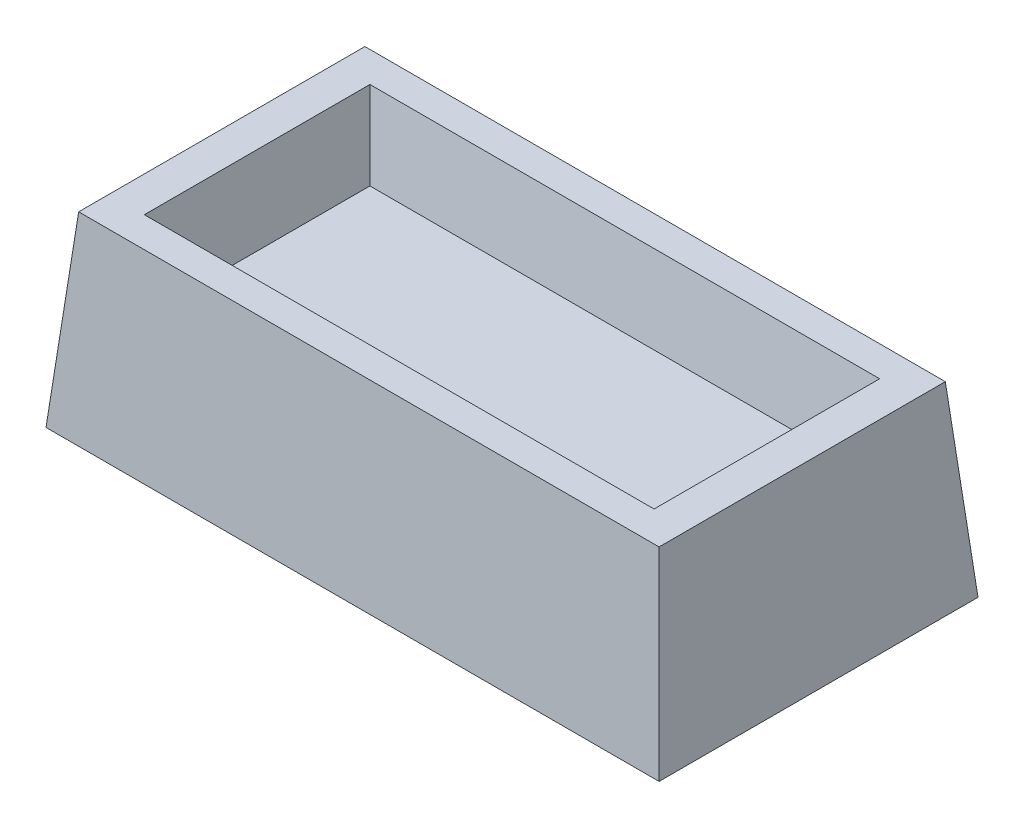
ISO-10303-21;
HEADER;
FILE_DESCRIPTION(('STEP AP214'),'2;1');
FILE_NAME('part.step','',(''),(''),'','','');
FILE_SCHEMA(('AUTOMOTIVE_DESIGN { 1 0 10303 214 1 1 1 1 }'));
ENDSEC;
DATA;
#1=APPLICATION_CONTEXT('core data for automotive mechanical design processes');
#2=APPLICATION_PROTOCOL_DEFINITION('international standard','automotive_design',2000,#1);
#3=PRODUCT_CONTEXT('',#1,'mechanical');
#4=PRODUCT('Part','Part','',(#3));
#5=PRODUCT_RELATED_PRODUCT_CATEGORY('part','',(#4));
#6=PRODUCT_DEFINITION_FORMATION('','',#4);
#7=PRODUCT_DEFINITION_CONTEXT('part definition',#1,'design');
#8=PRODUCT_DEFINITION('design','',#6,#7);
#9=PRODUCT_DEFINITION_SHAPE('','',#8);
#10=(LENGTH_UNIT() NAMED_UNIT(*) SI_UNIT(.MILLI.,.METRE.));
#11=(NAMED_UNIT(*) PLANE_ANGLE_UNIT() SI_UNIT($,.RADIAN.));
#12=(NAMED_UNIT(*) SI_UNIT($,.STERADIAN.) SOLID_ANGLE_UNIT());
#13=UNCERTAINTY_MEASURE_WITH_UNIT(LENGTH_MEASURE(1.E-05),#10,'distance_accuracy_value','');
#14=(GEOMETRIC_REPRESENTATION_CONTEXT(3) GLOBAL_UNCERTAINTY_ASSIGNED_CONTEXT((#13)) GLOBAL_UNIT_ASSIGNED_CONTEXT((#10,
#11,#12)) REPRESENTATION_CONTEXT('',''));
#15=CARTESIAN_POINT('',(0.,0.,0.));
#16=DIRECTION('',(0.,0.,1.));
#17=DIRECTION('',(1.,0.,0.));
#18=AXIS2_PLACEMENT_3D('',#15,#16,#17);
#19=CARTESIAN_POINT('',(0.,0.,0.));
#20=DIRECTION('',(0.,-1.,0.));
#21=DIRECTION('',(0.,0.,-1.));
#22=AXIS2_PLACEMENT_3D('',#19,#20,#21);
#23=PLANE('',#22);
#24=DIRECTION('',(1.,0.,0.));
#25=VECTOR('',#24,1.);
#26=CARTESIAN_POINT('',(-82.0684488740978,0.,42.6888302611235));
#27=LINE('',#26,#25);
#28=CARTESIAN_POINT('',(-82.0684488740978,0.,42.6888302611235));
#29=VERTEX_POINT('',#28);
#30=CARTESIAN_POINT('',(82.0684488740978,0.,42.6888302611235));
#31=VERTEX_POINT('',#30);
#32=EDGE_CURVE('E270',#29,#31,#27,.T.);
#33=ORIENTED_EDGE('',*,*,#32,.F.);
#34=DIRECTION('',(0.,0.,1.));
#35=VECTOR('',#34,1.);
#36=CARTESIAN_POINT('',(-82.0684488740978,0.,-42.6888302611235));
#37=LINE('',#36,#35);
#38=CARTESIAN_POINT('',(-82.0684488740978,0.,-42.6888302611235));
#39=VERTEX_POINT('',#38);
#40=EDGE_CURVE('E306',#39,#29,#37,.T.);
#41=ORIENTED_EDGE('',*,*,#40,.F.);
#42=DIRECTION('',(1.,0.,0.));
#43=VECTOR('',#42,1.);
#44=CARTESIAN_POINT('',(-82.0684488740978,0.,-42.6888302611235));
#45=LINE('',#44,#43);
#46=CARTESIAN_POINT('',(82.0684488740978,0.,-42.6888302611235));
#47=VERTEX_POINT('',#46);
#48=EDGE_CURVE('E302',#39,#47,#45,.T.);
#49=ORIENTED_EDGE('',*,*,#48,.T.);
#50=DIRECTION('',(0.,0.,1.));
#51=VECTOR('',#50,1.);
#52=CARTESIAN_POINT('',(82.0684488740978,0.,-42.6888302611235));
#53=LINE('',#52,#51);
#54=EDGE_CURVE('E298',#47,#31,#53,.T.);
#55=ORIENTED_EDGE('',*,*,#54,.T.);
#56=EDGE_LOOP('',(#33,#41,#49,#55));
#57=FACE_BOUND('',#56,.T.);
#58=DIRECTION('',(0.,0.,-1.));
#59=VECTOR('',#58,1.);
#60=CARTESIAN_POINT('',(-79.0569893614678,0.,0.));
#61=LINE('',#60,#59);
#62=CARTESIAN_POINT('',(-79.0569893614678,0.,-39.6773707484934));
#63=VERTEX_POINT('',#62);
#64=CARTESIAN_POINT('',(-79.0569893614678,0.,39.6773707484934));
#65=VERTEX_POINT('',#64);
#66=EDGE_CURVE('E170',#63,#65,#61,.F.);
#67=ORIENTED_EDGE('',*,*,#66,.T.);
#68=DIRECTION('',(-1.,0.,0.));
#69=VECTOR('',#68,1.);
#70=CARTESIAN_POINT('',(0.,0.,39.6773707484934));
#71=LINE('',#70,#69);
#72=CARTESIAN_POINT('',(79.0569893614678,0.,39.6773707484934));
#73=VERTEX_POINT('',#72);
#74=EDGE_CURVE('E227',#65,#73,#71,.F.);
#75=ORIENTED_EDGE('',*,*,#74,.T.);
#76=DIRECTION('',(0.,0.,1.));
#77=VECTOR('',#76,1.);
#78=CARTESIAN_POINT('',(79.0569893614678,0.,0.));
#79=LINE('',#78,#77);
#80=CARTESIAN_POINT('',(79.0569893614678,0.,-39.6773707484934));
#81=VERTEX_POINT('',#80);
#82=EDGE_CURVE('E177',#81,#73,#79,.T.);
#83=ORIENTED_EDGE('',*,*,#82,.F.);
#84=DIRECTION('',(1.,0.,0.));
#85=VECTOR('',#84,1.);
#86=CARTESIAN_POINT('',(0.,0.,-39.6773707484934));
#87=LINE('',#86,#85);
#88=EDGE_CURVE('E61',#63,#81,#87,.T.);
#89=ORIENTED_EDGE('',*,*,#88,.F.);
#90=EDGE_LOOP('',(#67,#75,#83,#89));
#91=FACE_BOUND('',#90,.T.);
#92=ADVANCED_FACE('F43',(#57,#91),#23,.T.);
#93=CARTESIAN_POINT('',(-82.0684488740978,0.,42.6888302611235));
#94=DIRECTION('',(0.,0.0871557427476582,0.996194698091745));
#95=DIRECTION('',(0.,-0.996194698091746,0.0871557427476582));
#96=AXIS2_PLACEMENT_3D('',#93,#94,#95);
#97=PLANE('',#96);
#98=ORIENTED_EDGE('',*,*,#32,.T.);
#99=DIRECTION('',(-0.0868265938642476,0.992432509138967,-0.0868265938642476));
#100=VECTOR('',#99,1.);
#101=CARTESIAN_POINT('',(80.8310442075565,14.143600058248,41.4514255945822));
#102=LINE('',#101,#100);
#103=CARTESIAN_POINT('',(77.6940156978016,50.,38.3143970848273));
#104=VERTEX_POINT('',#103);
#105=EDGE_CURVE('E11',#104,#31,#102,.F.);
#106=ORIENTED_EDGE('',*,*,#105,.F.);
#107=DIRECTION('',(-1.,0.,0.));
#108=VECTOR('',#107,1.);
#109=CARTESIAN_POINT('',(0.,50.,38.3143970848273));
#110=LINE('',#109,#108);
#111=CARTESIAN_POINT('',(-77.6940156978016,50.,38.3143970848273));
#112=VERTEX_POINT('',#111);
#113=EDGE_CURVE('E308',#112,#104,#110,.F.);
#114=ORIENTED_EDGE('',*,*,#113,.F.);
#115=DIRECTION('',(-0.0868265938642476,-0.992432509138967,0.0868265938642476));
#116=VECTOR('',#115,1.);
#117=CARTESIAN_POINT('',(-82.0684488740978,0.,42.6888302611235));
#118=LINE('',#117,#116);
#119=EDGE_CURVE('E310',#112,#29,#118,.T.);
#120=ORIENTED_EDGE('',*,*,#119,.T.);
#121=EDGE_LOOP('',(#98,#106,#114,#120));
#122=FACE_BOUND('',#121,.T.);
#123=ADVANCED_FACE('F342',(#122),#97,.T.);
#124=CARTESIAN_POINT('',(82.0684488740978,0.,-42.6888302611235));
#125=DIRECTION('',(0.996194698091746,0.0871557427476582,0.));
#126=DIRECTION('',(-0.0871557427476582,0.996194698091746,0.));
#127=AXIS2_PLACEMENT_3D('',#124,#125,#126);
#128=PLANE('',#127);
#129=ORIENTED_EDGE('',*,*,#54,.F.);
#130=DIRECTION('',(0.0868265938642476,-0.992432509138967,-0.0868265938642476));
#131=VECTOR('',#130,1.);
#132=CARTESIAN_POINT('',(80.8310442075565,14.143600058248,-41.4514255945822));
#133=LINE('',#132,#131);
#134=CARTESIAN_POINT('',(77.6940156978016,50.,-38.3143970848273));
#135=VERTEX_POINT('',#134);
#136=EDGE_CURVE('E53',#135,#47,#133,.T.);
#137=ORIENTED_EDGE('',*,*,#136,.F.);
#138=DIRECTION('',(0.,0.,1.));
#139=VECTOR('',#138,1.);
#140=CARTESIAN_POINT('',(77.6940156978016,50.,0.));
#141=LINE('',#140,#139);
#142=EDGE_CURVE('E321',#135,#104,#141,.T.);
#143=ORIENTED_EDGE('',*,*,#142,.T.);
#144=ORIENTED_EDGE('',*,*,#105,.T.);
#145=EDGE_LOOP('',(#129,#137,#143,#144));
#146=FACE_BOUND('',#145,.T.);
#147=ADVANCED_FACE('F45',(#146),#128,.T.);
#148=CARTESIAN_POINT('',(-82.0684488740978,0.,-42.6888302611235));
#149=DIRECTION('',(0.,0.0871557427476582,-0.996194698091745));
#150=DIRECTION('',(0.,0.996194698091746,0.0871557427476582));
#151=AXIS2_PLACEMENT_3D('',#148,#149,#150);
#152=PLANE('',#151);
#153=ORIENTED_EDGE('',*,*,#48,.F.);
#154=DIRECTION('',(0.0868265938642476,0.992432509138967,0.0868265938642476));
#155=VECTOR('',#154,1.);
#156=CARTESIAN_POINT('',(-82.0684488740978,0.,-42.6888302611235));
#157=LINE('',#156,#155);
#158=CARTESIAN_POINT('',(-77.6940156978016,50.,-38.3143970848273));
#159=VERTEX_POINT('',#158);
#160=EDGE_CURVE('E314',#159,#39,#157,.F.);
#161=ORIENTED_EDGE('',*,*,#160,.F.);
#162=DIRECTION('',(1.,0.,0.));
#163=VECTOR('',#162,1.);
#164=CARTESIAN_POINT('',(0.,50.,-38.3143970848273));
#165=LINE('',#164,#163);
#166=EDGE_CURVE('E324',#159,#135,#165,.T.);
#167=ORIENTED_EDGE('',*,*,#166,.T.);
#168=ORIENTED_EDGE('',*,*,#136,.T.);
#169=EDGE_LOOP('',(#153,#161,#167,#168));
#170=FACE_BOUND('',#169,.T.);
#171=ADVANCED_FACE('F346',(#170),#152,.T.);
#172=CARTESIAN_POINT('',(-82.0684488740978,0.,-42.6888302611235));
#173=DIRECTION('',(-0.996194698091746,0.0871557427476582,0.));
#174=DIRECTION('',(-0.0871557427476582,-0.996194698091746,0.));
#175=AXIS2_PLACEMENT_3D('',#172,#173,#174);
#176=PLANE('',#175);
#177=ORIENTED_EDGE('',*,*,#40,.T.);
#178=ORIENTED_EDGE('',*,*,#119,.F.);
#179=DIRECTION('',(0.,0.,-1.));
#180=VECTOR('',#179,1.);
#181=CARTESIAN_POINT('',(-77.6940156978016,50.,0.));
#182=LINE('',#181,#180);
#183=EDGE_CURVE('E47',#159,#112,#182,.F.);
#184=ORIENTED_EDGE('',*,*,#183,.F.);
#185=ORIENTED_EDGE('',*,*,#160,.T.);
#186=EDGE_LOOP('',(#177,#178,#184,#185));
#187=FACE_BOUND('',#186,.T.);
#188=ADVANCED_FACE('F338',(#187),#176,.T.);
#189=CARTESIAN_POINT('',(0.,50.,0.));
#190=DIRECTION('',(0.,-1.,0.));
#191=DIRECTION('',(0.,0.,-1.));
#192=AXIS2_PLACEMENT_3D('',#189,#190,#191);
#193=PLANE('',#192);
#194=DIRECTION('',(-1.,0.,0.));
#195=VECTOR('',#194,1.);
#196=CARTESIAN_POINT('',(-68.2338946785551,50.,-30.1954591393604));
#197=LINE('',#196,#195);
#198=CARTESIAN_POINT('',(68.2338946785551,50.,-30.1954591393604));
#199=VERTEX_POINT('',#198);
#200=CARTESIAN_POINT('',(-68.2338946785551,50.,-30.1954591393604));
#201=VERTEX_POINT('',#200);
#202=EDGE_CURVE('E254',#199,#201,#197,.T.);
#203=ORIENTED_EDGE('',*,*,#202,.F.);
#204=DIRECTION('',(0.,0.,-1.));
#205=VECTOR('',#204,1.);
#206=CARTESIAN_POINT('',(68.2338946785551,50.,-30.1954591393604));
#207=LINE('',#206,#205);
#208=CARTESIAN_POINT('',(68.2338946785551,50.,30.1954591393604));
#209=VERTEX_POINT('',#208);
#210=EDGE_CURVE('E69',#209,#199,#207,.T.);
#211=ORIENTED_EDGE('',*,*,#210,.F.);
#212=DIRECTION('',(1.,0.,0.));
#213=VECTOR('',#212,1.);
#214=CARTESIAN_POINT('',(-68.2338946785551,50.,30.1954591393604));
#215=LINE('',#214,#213);
#216=CARTESIAN_POINT('',(-68.2338946785551,50.,30.1954591393604));
#217=VERTEX_POINT('',#216);
#218=EDGE_CURVE('E262',#217,#209,#215,.T.);
#219=ORIENTED_EDGE('',*,*,#218,.F.);
#220=DIRECTION('',(0.,0.,1.));
#221=VECTOR('',#220,1.);
#222=CARTESIAN_POINT('',(-68.2338946785551,50.,-30.1954591393604));
#223=LINE('',#222,#221);
#224=EDGE_CURVE('E258',#201,#217,#223,.T.);
#225=ORIENTED_EDGE('',*,*,#224,.F.);
#226=EDGE_LOOP('',(#203,#211,#219,#225));
#227=FACE_BOUND('',#226,.T.);
#228=ORIENTED_EDGE('',*,*,#113,.T.);
#229=ORIENTED_EDGE('',*,*,#142,.F.);
#230=ORIENTED_EDGE('',*,*,#166,.F.);
#231=ORIENTED_EDGE('',*,*,#183,.T.);
#232=EDGE_LOOP('',(#228,#229,#230,#231));
#233=FACE_BOUND('',#232,.T.);
#234=ADVANCED_FACE('F333',(#227,#233),#193,.F.);
#235=CARTESIAN_POINT('',(68.2338946785551,50.,-30.1954591393604));
#236=DIRECTION('',(0.984807753012208,-0.17364817766693,0.));
#237=DIRECTION('',(0.17364817766693,0.984807753012208,0.));
#238=AXIS2_PLACEMENT_3D('',#235,#236,#237);
#239=PLANE('',#238);
#240=ORIENTED_EDGE('',*,*,#210,.T.);
#241=DIRECTION('',(0.171087869746036,0.970287525247814,-0.171087869746036));
#242=VECTOR('',#241,1.);
#243=CARTESIAN_POINT('',(68.2338946785551,50.,-30.1954591393604));
#244=LINE('',#243,#242);
#245=CARTESIAN_POINT('',(64.7073550643858,30.,-26.6689195251911));
#246=VERTEX_POINT('',#245);
#247=EDGE_CURVE('E272',#246,#199,#244,.T.);
#248=ORIENTED_EDGE('',*,*,#247,.F.);
#249=DIRECTION('',(0.,0.,-1.));
#250=VECTOR('',#249,1.);
#251=CARTESIAN_POINT('',(64.7073550643858,30.,0.));
#252=LINE('',#251,#250);
#253=CARTESIAN_POINT('',(64.7073550643858,30.,26.6689195251911));
#254=VERTEX_POINT('',#253);
#255=EDGE_CURVE('E266',#254,#246,#252,.T.);
#256=ORIENTED_EDGE('',*,*,#255,.F.);
#257=DIRECTION('',(0.171087869746036,0.970287525247814,0.171087869746036));
#258=VECTOR('',#257,1.);
#259=CARTESIAN_POINT('',(64.2393379409059,27.3457429963387,26.2009024017112));
#260=LINE('',#259,#258);
#261=EDGE_CURVE('E267',#254,#209,#260,.T.);
#262=ORIENTED_EDGE('',*,*,#261,.T.);
#263=EDGE_LOOP('',(#240,#248,#256,#262));
#264=FACE_BOUND('',#263,.T.);
#265=ADVANCED_FACE('F395',(#264),#239,.F.);
#266=CARTESIAN_POINT('',(-68.2338946785551,50.,30.1954591393604));
#267=DIRECTION('',(0.,-0.17364817766693,0.984807753012208));
#268=DIRECTION('',(0.,-0.984807753012208,-0.17364817766693));
#269=AXIS2_PLACEMENT_3D('',#266,#267,#268);
#270=PLANE('',#269);
#271=ORIENTED_EDGE('',*,*,#218,.T.);
#272=ORIENTED_EDGE('',*,*,#261,.F.);
#273=DIRECTION('',(1.,0.,0.));
#274=VECTOR('',#273,1.);
#275=CARTESIAN_POINT('',(0.,30.,26.6689195251911));
#276=LINE('',#275,#274);
#277=CARTESIAN_POINT('',(-64.7073550643858,30.,26.6689195251911));
#278=VERTEX_POINT('',#277);
#279=EDGE_CURVE('E276',#278,#254,#276,.T.);
#280=ORIENTED_EDGE('',*,*,#279,.F.);
#281=DIRECTION('',(-0.171087869746036,0.970287525247814,0.171087869746036));
#282=VECTOR('',#281,1.);
#283=CARTESIAN_POINT('',(-66.4661885360321,39.9748402914833,28.4277529968375));
#284=LINE('',#283,#282);
#285=EDGE_CURVE('E271',#278,#217,#284,.T.);
#286=ORIENTED_EDGE('',*,*,#285,.T.);
#287=EDGE_LOOP('',(#271,#272,#280,#286));
#288=FACE_BOUND('',#287,.T.);
#289=ADVANCED_FACE('F398',(#288),#270,.F.);
#290=CARTESIAN_POINT('',(-68.2338946785551,50.,-30.1954591393604));
#291=DIRECTION('',(-0.984807753012208,-0.17364817766693,0.));
#292=DIRECTION('',(0.17364817766693,-0.984807753012208,0.));
#293=AXIS2_PLACEMENT_3D('',#290,#291,#292);
#294=PLANE('',#293);
#295=ORIENTED_EDGE('',*,*,#224,.T.);
#296=ORIENTED_EDGE('',*,*,#285,.F.);
#297=DIRECTION('',(0.,0.,1.));
#298=VECTOR('',#297,1.);
#299=CARTESIAN_POINT('',(-64.7073550643858,30.,0.));
#300=LINE('',#299,#298);
#301=CARTESIAN_POINT('',(-64.7073550643858,30.,-26.6689195251911));
#302=VERTEX_POINT('',#301);
#303=EDGE_CURVE('E288',#302,#278,#300,.T.);
#304=ORIENTED_EDGE('',*,*,#303,.F.);
#305=DIRECTION('',(-0.171087869746036,0.970287525247814,-0.171087869746036));
#306=VECTOR('',#305,1.);
#307=CARTESIAN_POINT('',(-68.2338946785551,50.,-30.1954591393604));
#308=LINE('',#307,#306);
#309=EDGE_CURVE('E275',#302,#201,#308,.T.);
#310=ORIENTED_EDGE('',*,*,#309,.T.);
#311=EDGE_LOOP('',(#295,#296,#304,#310));
#312=FACE_BOUND('',#311,.T.);
#313=ADVANCED_FACE('F401',(#312),#294,.F.);
#314=CARTESIAN_POINT('',(-68.2338946785551,50.,-30.1954591393604));
#315=DIRECTION('',(0.,-0.17364817766693,-0.984807753012208));
#316=DIRECTION('',(0.,0.984807753012208,-0.17364817766693));
#317=AXIS2_PLACEMENT_3D('',#314,#315,#316);
#318=PLANE('',#317);
#319=ORIENTED_EDGE('',*,*,#202,.T.);
#320=ORIENTED_EDGE('',*,*,#309,.F.);
#321=DIRECTION('',(-1.,0.,0.));
#322=VECTOR('',#321,1.);
#323=CARTESIAN_POINT('',(0.,30.,-26.6689195251911));
#324=LINE('',#323,#322);
#325=EDGE_CURVE('E284',#246,#302,#324,.T.);
#326=ORIENTED_EDGE('',*,*,#325,.F.);
#327=ORIENTED_EDGE('',*,*,#247,.T.);
#328=EDGE_LOOP('',(#319,#320,#326,#327));
#329=FACE_BOUND('',#328,.T.);
#330=ADVANCED_FACE('F393',(#329),#318,.F.);
#331=CARTESIAN_POINT('',(0.,30.,0.));
#332=DIRECTION('',(0.,1.,0.));
#333=DIRECTION('',(0.,0.,1.));
#334=AXIS2_PLACEMENT_3D('',#331,#332,#333);
#335=PLANE('',#334);
#336=ORIENTED_EDGE('',*,*,#255,.T.);
#337=ORIENTED_EDGE('',*,*,#325,.T.);
#338=ORIENTED_EDGE('',*,*,#303,.T.);
#339=ORIENTED_EDGE('',*,*,#279,.T.);
#340=EDGE_LOOP('',(#336,#337,#338,#339));
#341=FACE_BOUND('',#340,.T.);
#342=ADVANCED_FACE('F390',(#341),#335,.T.);
#343=CARTESIAN_POINT('',(-82.0684488740978,-0.261467228242975,39.7002461668482));
#344=DIRECTION('',(0.,0.0871557427476582,0.996194698091745));
#345=DIRECTION('',(0.,-0.996194698091746,0.0871557427476582));
#346=AXIS2_PLACEMENT_3D('',#343,#344,#345);
#347=PLANE('',#346);
#348=ORIENTED_EDGE('',*,*,#74,.F.);
#349=DIRECTION('',(-0.0868265938642476,-0.992432509138967,0.0868265938642476));
#350=VECTOR('',#349,1.);
#351=CARTESIAN_POINT('',(-79.1023952891434,-0.518992128187875,39.7227766761691));
#352=LINE('',#351,#350);
#353=CARTESIAN_POINT('',(-74.9450221757493,47.,35.565403562775));
#354=VERTEX_POINT('',#353);
#355=EDGE_CURVE('E164',#354,#65,#352,.T.);
#356=ORIENTED_EDGE('',*,*,#355,.F.);
#357=DIRECTION('',(-1.,0.,0.));
#358=VECTOR('',#357,1.);
#359=CARTESIAN_POINT('',(0.,47.,35.565403562775));
#360=LINE('',#359,#358);
#361=CARTESIAN_POINT('',(74.9450221757493,47.,35.565403562775));
#362=VERTEX_POINT('',#361);
#363=EDGE_CURVE('E158',#354,#362,#360,.F.);
#364=ORIENTED_EDGE('',*,*,#363,.T.);
#365=DIRECTION('',(-0.0868265938642476,0.992432509138967,-0.0868265938642476));
#366=VECTOR('',#365,1.);
#367=CARTESIAN_POINT('',(77.8649906226021,13.6246079300601,38.4853720096278));
#368=LINE('',#367,#366);
#369=EDGE_CURVE('E162',#362,#73,#368,.F.);
#370=ORIENTED_EDGE('',*,*,#369,.T.);
#371=EDGE_LOOP('',(#348,#356,#364,#370));
#372=FACE_BOUND('',#371,.T.);
#373=ADVANCED_FACE('F161',(#372),#347,.F.);
#374=CARTESIAN_POINT('',(79.0798647798226,-0.261467228242975,-42.6888302611235));
#375=DIRECTION('',(0.996194698091746,0.0871557427476582,0.));
#376=DIRECTION('',(-0.0871557427476582,0.996194698091746,0.));
#377=AXIS2_PLACEMENT_3D('',#374,#375,#376);
#378=PLANE('',#377);
#379=ORIENTED_EDGE('',*,*,#82,.T.);
#380=ORIENTED_EDGE('',*,*,#369,.F.);
#381=DIRECTION('',(0.,0.,1.));
#382=VECTOR('',#381,1.);
#383=CARTESIAN_POINT('',(74.9450221757493,47.,0.));
#384=LINE('',#383,#382);
#385=CARTESIAN_POINT('',(74.9450221757493,47.,-35.565403562775));
#386=VERTEX_POINT('',#385);
#387=EDGE_CURVE('E169',#386,#362,#384,.T.);
#388=ORIENTED_EDGE('',*,*,#387,.F.);
#389=DIRECTION('',(0.0868265938642476,-0.992432509138967,-0.0868265938642476));
#390=VECTOR('',#389,1.);
#391=CARTESIAN_POINT('',(77.8649906226021,13.6246079300601,-38.4853720096278));
#392=LINE('',#391,#390);
#393=EDGE_CURVE('E180',#386,#81,#392,.T.);
#394=ORIENTED_EDGE('',*,*,#393,.T.);
#395=EDGE_LOOP('',(#379,#380,#388,#394));
#396=FACE_BOUND('',#395,.T.);
#397=ADVANCED_FACE('F174',(#396),#378,.F.);
#398=CARTESIAN_POINT('',(-82.0684488740978,-0.261467228242975,-39.7002461668482));
#399=DIRECTION('',(0.,0.0871557427476582,-0.996194698091745));
#400=DIRECTION('',(0.,0.996194698091746,0.0871557427476582));
#401=AXIS2_PLACEMENT_3D('',#398,#399,#400);
#402=PLANE('',#401);
#403=ORIENTED_EDGE('',*,*,#88,.T.);
#404=ORIENTED_EDGE('',*,*,#393,.F.);
#405=DIRECTION('',(1.,0.,0.));
#406=VECTOR('',#405,1.);
#407=CARTESIAN_POINT('',(0.,47.,-35.565403562775));
#408=LINE('',#407,#406);
#409=CARTESIAN_POINT('',(-74.9450221757493,47.,-35.565403562775));
#410=VERTEX_POINT('',#409);
#411=EDGE_CURVE('E184',#410,#386,#408,.T.);
#412=ORIENTED_EDGE('',*,*,#411,.F.);
#413=DIRECTION('',(0.0868265938642476,0.992432509138967,0.0868265938642476));
#414=VECTOR('',#413,1.);
#415=CARTESIAN_POINT('',(-79.1023952891434,-0.518992128187875,-39.7227766761691));
#416=LINE('',#415,#414);
#417=EDGE_CURVE('E193',#410,#63,#416,.F.);
#418=ORIENTED_EDGE('',*,*,#417,.T.);
#419=EDGE_LOOP('',(#403,#404,#412,#418));
#420=FACE_BOUND('',#419,.T.);
#421=ADVANCED_FACE('F356',(#420),#402,.F.);
#422=CARTESIAN_POINT('',(-79.0798647798226,-0.261467228242975,-42.6888302611235));
#423=DIRECTION('',(-0.996194698091746,0.0871557427476582,0.));
#424=DIRECTION('',(-0.0871557427476582,-0.996194698091746,0.));
#425=AXIS2_PLACEMENT_3D('',#422,#423,#424);
#426=PLANE('',#425);
#427=ORIENTED_EDGE('',*,*,#66,.F.);
#428=ORIENTED_EDGE('',*,*,#417,.F.);
#429=DIRECTION('',(0.,0.,-1.));
#430=VECTOR('',#429,1.);
#431=CARTESIAN_POINT('',(-74.9450221757493,47.,0.));
#432=LINE('',#431,#430);
#433=EDGE_CURVE('E188',#410,#354,#432,.F.);
#434=ORIENTED_EDGE('',*,*,#433,.T.);
#435=ORIENTED_EDGE('',*,*,#355,.T.);
#436=EDGE_LOOP('',(#427,#428,#434,#435));
#437=FACE_BOUND('',#436,.T.);
#438=ADVANCED_FACE('F353',(#437),#426,.F.);
#439=CARTESIAN_POINT('',(0.,47.,0.));
#440=DIRECTION('',(0.,-1.,0.));
#441=DIRECTION('',(0.,0.,-1.));
#442=AXIS2_PLACEMENT_3D('',#439,#440,#441);
#443=PLANE('',#442);
#444=DIRECTION('',(-1.,0.,0.));
#445=VECTOR('',#444,1.);
#446=CARTESIAN_POINT('',(-68.2338946785551,47.,-32.7127580328922));
#447=LINE('',#446,#445);
#448=CARTESIAN_POINT('',(70.7511935720869,47.,-32.7127580328922));
#449=VERTEX_POINT('',#448);
#450=CARTESIAN_POINT('',(-70.7511935720869,47.,-32.7127580328922));
#451=VERTEX_POINT('',#450);
#452=EDGE_CURVE('E198',#449,#451,#447,.T.);
#453=ORIENTED_EDGE('',*,*,#452,.T.);
#454=DIRECTION('',(0.,0.,1.));
#455=VECTOR('',#454,1.);
#456=CARTESIAN_POINT('',(-70.7511935720869,47.,-30.1954591393604));
#457=LINE('',#456,#455);
#458=CARTESIAN_POINT('',(-70.7511935720869,47.,32.7127580328922));
#459=VERTEX_POINT('',#458);
#460=EDGE_CURVE('E202',#451,#459,#457,.T.);
#461=ORIENTED_EDGE('',*,*,#460,.T.);
#462=DIRECTION('',(1.,0.,0.));
#463=VECTOR('',#462,1.);
#464=CARTESIAN_POINT('',(-68.2338946785551,47.,32.7127580328922));
#465=LINE('',#464,#463);
#466=CARTESIAN_POINT('',(70.7511935720869,47.,32.7127580328922));
#467=VERTEX_POINT('',#466);
#468=EDGE_CURVE('E206',#459,#467,#465,.T.);
#469=ORIENTED_EDGE('',*,*,#468,.T.);
#470=DIRECTION('',(0.,0.,-1.));
#471=VECTOR('',#470,1.);
#472=CARTESIAN_POINT('',(70.7511935720869,47.,-30.1954591393604));
#473=LINE('',#472,#471);
#474=EDGE_CURVE('E203',#467,#449,#473,.T.);
#475=ORIENTED_EDGE('',*,*,#474,.T.);
#476=EDGE_LOOP('',(#453,#461,#469,#475));
#477=FACE_BOUND('',#476,.T.);
#478=ORIENTED_EDGE('',*,*,#363,.F.);
#479=ORIENTED_EDGE('',*,*,#433,.F.);
#480=ORIENTED_EDGE('',*,*,#411,.T.);
#481=ORIENTED_EDGE('',*,*,#387,.T.);
#482=EDGE_LOOP('',(#478,#479,#480,#481));
#483=FACE_BOUND('',#482,.T.);
#484=ADVANCED_FACE('F182',(#477,#483),#443,.T.);
#485=CARTESIAN_POINT('',(71.1883179375917,49.4790554669992,-30.1954591393604));
#486=DIRECTION('',(0.984807753012208,-0.17364817766693,0.));
#487=DIRECTION('',(0.17364817766693,0.984807753012208,0.));
#488=AXIS2_PLACEMENT_3D('',#485,#486,#487);
#489=PLANE('',#488);
#490=ORIENTED_EDGE('',*,*,#474,.F.);
#491=DIRECTION('',(0.171087869746036,0.970287525247814,0.171087869746036));
#492=VECTOR('',#491,1.);
#493=CARTESIAN_POINT('',(67.1072821019015,26.334351126841,29.0688465627068));
#494=LINE('',#493,#492);
#495=CARTESIAN_POINT('',(67.2246539579176,27.,29.1862184187229));
#496=VERTEX_POINT('',#495);
#497=EDGE_CURVE('E224',#496,#467,#494,.T.);
#498=ORIENTED_EDGE('',*,*,#497,.F.);
#499=DIRECTION('',(0.,0.,-1.));
#500=VECTOR('',#499,1.);
#501=CARTESIAN_POINT('',(67.2246539579176,27.,0.));
#502=LINE('',#501,#500);
#503=CARTESIAN_POINT('',(67.2246539579176,27.,-29.1862184187229));
#504=VERTEX_POINT('',#503);
#505=EDGE_CURVE('E210',#496,#504,#502,.T.);
#506=ORIENTED_EDGE('',*,*,#505,.T.);
#507=DIRECTION('',(0.171087869746036,0.970287525247814,-0.171087869746036));
#508=VECTOR('',#507,1.);
#509=CARTESIAN_POINT('',(71.1018388395507,48.9886081305024,-33.063403300356));
#510=LINE('',#509,#508);
#511=EDGE_CURVE('E214',#504,#449,#510,.T.);
#512=ORIENTED_EDGE('',*,*,#511,.T.);
#513=EDGE_LOOP('',(#490,#498,#506,#512));
#514=FACE_BOUND('',#513,.T.);
#515=ADVANCED_FACE('F369',(#514),#489,.T.);
#516=CARTESIAN_POINT('',(-68.2338946785551,49.4790554669992,33.149882398397));
#517=DIRECTION('',(0.,-0.17364817766693,0.984807753012208));
#518=DIRECTION('',(0.,-0.984807753012208,-0.17364817766693));
#519=AXIS2_PLACEMENT_3D('',#516,#517,#518);
#520=PLANE('',#519);
#521=ORIENTED_EDGE('',*,*,#468,.F.);
#522=DIRECTION('',(-0.171087869746036,0.970287525247814,0.171087869746036));
#523=VECTOR('',#522,1.);
#524=CARTESIAN_POINT('',(-69.3341326970278,38.9634484219856,31.2956971578331));
#525=LINE('',#524,#523);
#526=CARTESIAN_POINT('',(-67.2246539579176,27.,29.1862184187229));
#527=VERTEX_POINT('',#526);
#528=EDGE_CURVE('E228',#527,#459,#525,.T.);
#529=ORIENTED_EDGE('',*,*,#528,.F.);
#530=DIRECTION('',(1.,0.,0.));
#531=VECTOR('',#530,1.);
#532=CARTESIAN_POINT('',(0.,27.,29.1862184187229));
#533=LINE('',#532,#531);
#534=EDGE_CURVE('E219',#527,#496,#533,.T.);
#535=ORIENTED_EDGE('',*,*,#534,.T.);
#536=ORIENTED_EDGE('',*,*,#497,.T.);
#537=EDGE_LOOP('',(#521,#529,#535,#536));
#538=FACE_BOUND('',#537,.T.);
#539=ADVANCED_FACE('F373',(#538),#520,.T.);
#540=CARTESIAN_POINT('',(-71.1883179375917,49.4790554669992,-30.1954591393604));
#541=DIRECTION('',(-0.984807753012208,-0.17364817766693,0.));
#542=DIRECTION('',(0.17364817766693,-0.984807753012208,0.));
#543=AXIS2_PLACEMENT_3D('',#540,#541,#542);
#544=PLANE('',#543);
#545=ORIENTED_EDGE('',*,*,#460,.F.);
#546=DIRECTION('',(-0.171087869746036,0.970287525247814,-0.171087869746036));
#547=VECTOR('',#546,1.);
#548=CARTESIAN_POINT('',(-71.1018388395507,48.9886081305024,-33.063403300356));
#549=LINE('',#548,#547);
#550=CARTESIAN_POINT('',(-67.2246539579176,27.,-29.1862184187229));
#551=VERTEX_POINT('',#550);
#552=EDGE_CURVE('E218',#551,#451,#549,.T.);
#553=ORIENTED_EDGE('',*,*,#552,.F.);
#554=DIRECTION('',(0.,0.,1.));
#555=VECTOR('',#554,1.);
#556=CARTESIAN_POINT('',(-67.2246539579176,27.,0.));
#557=LINE('',#556,#555);
#558=EDGE_CURVE('E232',#551,#527,#557,.T.);
#559=ORIENTED_EDGE('',*,*,#558,.T.);
#560=ORIENTED_EDGE('',*,*,#528,.T.);
#561=EDGE_LOOP('',(#545,#553,#559,#560));
#562=FACE_BOUND('',#561,.T.);
#563=ADVANCED_FACE('F377',(#562),#544,.T.);
#564=CARTESIAN_POINT('',(-68.2338946785551,49.4790554669992,-33.149882398397));
#565=DIRECTION('',(0.,-0.17364817766693,-0.984807753012208));
#566=DIRECTION('',(0.,0.984807753012208,-0.17364817766693));
#567=AXIS2_PLACEMENT_3D('',#564,#565,#566);
#568=PLANE('',#567);
#569=ORIENTED_EDGE('',*,*,#452,.F.);
#570=ORIENTED_EDGE('',*,*,#511,.F.);
#571=DIRECTION('',(-1.,0.,0.));
#572=VECTOR('',#571,1.);
#573=CARTESIAN_POINT('',(0.,27.,-29.1862184187229));
#574=LINE('',#573,#572);
#575=EDGE_CURVE('E223',#504,#551,#574,.T.);
#576=ORIENTED_EDGE('',*,*,#575,.T.);
#577=ORIENTED_EDGE('',*,*,#552,.T.);
#578=EDGE_LOOP('',(#569,#570,#576,#577));
#579=FACE_BOUND('',#578,.T.);
#580=ADVANCED_FACE('F381',(#579),#568,.T.);
#581=CARTESIAN_POINT('',(0.,27.,0.));
#582=DIRECTION('',(0.,1.,0.));
#583=DIRECTION('',(0.,0.,1.));
#584=AXIS2_PLACEMENT_3D('',#581,#582,#583);
#585=PLANE('',#584);
#586=ORIENTED_EDGE('',*,*,#505,.F.);
#587=ORIENTED_EDGE('',*,*,#534,.F.);
#588=ORIENTED_EDGE('',*,*,#558,.F.);
#589=ORIENTED_EDGE('',*,*,#575,.F.);
#590=EDGE_LOOP('',(#586,#587,#588,#589));
#591=FACE_BOUND('',#590,.T.);
#592=ADVANCED_FACE('F385',(#591),#585,.F.);
#593=CLOSED_SHELL('',(#92,#123,#147,#171,#188,#234,#265,#289,#313,#330,#342,#373,#397,#421,#438,
#484,#515,#539,#563,#580,#592));
#594=MANIFOLD_SOLID_BREP('B2',#593);
#595=ADVANCED_BREP_SHAPE_REPRESENTATION('',(#18,#594),#14);
#596=SHAPE_DEFINITION_REPRESENTATION(#9,#595);
ENDSEC;
END-ISO-10303-21;
